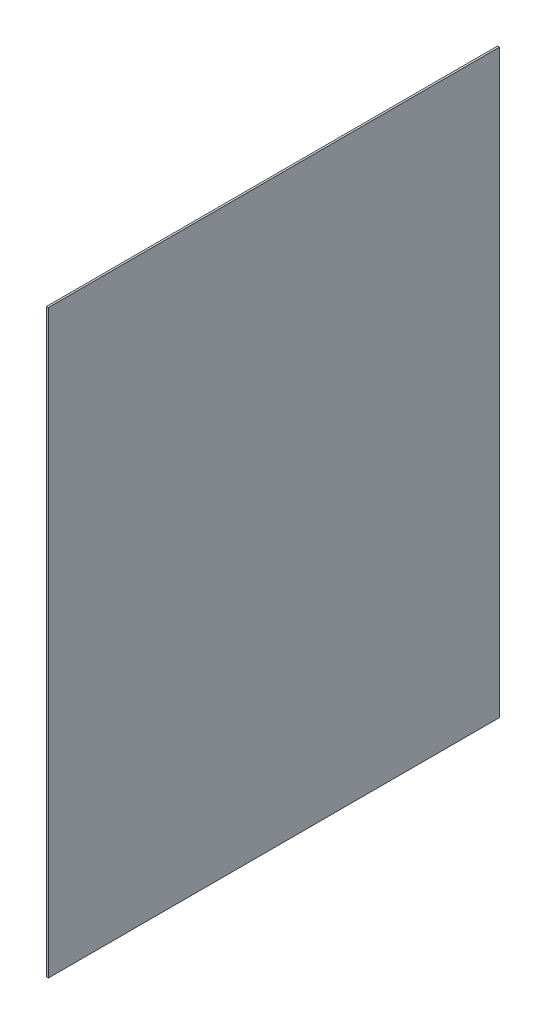
ISO-10303-21;
HEADER;
FILE_DESCRIPTION(('STEP AP214'),'2;1');
FILE_NAME('part.step','',(''),(''),'','','');
FILE_SCHEMA(('AUTOMOTIVE_DESIGN { 1 0 10303 214 1 1 1 1 }'));
ENDSEC;
DATA;
#1=APPLICATION_CONTEXT('core data for automotive mechanical design processes');
#2=APPLICATION_PROTOCOL_DEFINITION('international standard','automotive_design',2000,#1);
#3=PRODUCT_CONTEXT('',#1,'mechanical');
#4=PRODUCT('Part','Part','',(#3));
#5=PRODUCT_RELATED_PRODUCT_CATEGORY('part','',(#4));
#6=PRODUCT_DEFINITION_FORMATION('','',#4);
#7=PRODUCT_DEFINITION_CONTEXT('part definition',#1,'design');
#8=PRODUCT_DEFINITION('design','',#6,#7);
#9=PRODUCT_DEFINITION_SHAPE('','',#8);
#10=(LENGTH_UNIT() NAMED_UNIT(*) SI_UNIT(.MILLI.,.METRE.));
#11=(NAMED_UNIT(*) PLANE_ANGLE_UNIT() SI_UNIT($,.RADIAN.));
#12=(NAMED_UNIT(*) SI_UNIT($,.STERADIAN.) SOLID_ANGLE_UNIT());
#13=UNCERTAINTY_MEASURE_WITH_UNIT(LENGTH_MEASURE(1.E-05),#10,'distance_accuracy_value','');
#14=(GEOMETRIC_REPRESENTATION_CONTEXT(3) GLOBAL_UNCERTAINTY_ASSIGNED_CONTEXT((#13)) GLOBAL_UNIT_ASSIGNED_CONTEXT((#10,
#11,#12)) REPRESENTATION_CONTEXT('',''));
#15=CARTESIAN_POINT('',(0.,0.,0.));
#16=DIRECTION('',(0.,0.,1.));
#17=DIRECTION('',(1.,0.,0.));
#18=AXIS2_PLACEMENT_3D('',#15,#16,#17);
#19=CARTESIAN_POINT('',(0.1,0.,0.));
#20=DIRECTION('',(0.,0.,-1.));
#21=DIRECTION('',(-1.,0.,0.));
#22=AXIS2_PLACEMENT_3D('',#19,#20,#21);
#23=PLANE('',#22);
#24=DIRECTION('',(0.,-1.,0.));
#25=VECTOR('',#24,1.);
#26=CARTESIAN_POINT('',(0.,0.,0.));
#27=LINE('',#26,#25);
#28=CARTESIAN_POINT('',(0.,30.,0.));
#29=VERTEX_POINT('',#28);
#30=CARTESIAN_POINT('',(0.,0.,0.));
#31=VERTEX_POINT('',#30);
#32=EDGE_CURVE('E95',#29,#31,#27,.T.);
#33=ORIENTED_EDGE('',*,*,#32,.T.);
#34=DIRECTION('',(-1.,0.,0.));
#35=VECTOR('',#34,1.);
#36=CARTESIAN_POINT('',(0.1,0.,0.));
#37=LINE('',#36,#35);
#38=CARTESIAN_POINT('',(0.1,0.,0.));
#39=VERTEX_POINT('',#38);
#40=EDGE_CURVE('E11',#39,#31,#37,.T.);
#41=ORIENTED_EDGE('',*,*,#40,.F.);
#42=DIRECTION('',(0.,-1.,0.));
#43=VECTOR('',#42,1.);
#44=CARTESIAN_POINT('',(0.1,0.,0.));
#45=LINE('',#44,#43);
#46=CARTESIAN_POINT('',(0.1,30.,0.));
#47=VERTEX_POINT('',#46);
#48=EDGE_CURVE('E83',#47,#39,#45,.T.);
#49=ORIENTED_EDGE('',*,*,#48,.F.);
#50=DIRECTION('',(-1.,0.,0.));
#51=VECTOR('',#50,1.);
#52=CARTESIAN_POINT('',(0.1,30.,0.));
#53=LINE('',#52,#51);
#54=EDGE_CURVE('E91',#47,#29,#53,.T.);
#55=ORIENTED_EDGE('',*,*,#54,.T.);
#56=EDGE_LOOP('',(#33,#41,#49,#55));
#57=FACE_BOUND('',#56,.T.);
#58=ADVANCED_FACE('F32',(#57),#23,.F.);
#59=CARTESIAN_POINT('',(0.1,0.,0.));
#60=DIRECTION('',(0.,1.,0.));
#61=DIRECTION('',(0.,0.,1.));
#62=AXIS2_PLACEMENT_3D('',#59,#60,#61);
#63=PLANE('',#62);
#64=DIRECTION('',(0.,0.,-1.));
#65=VECTOR('',#64,1.);
#66=CARTESIAN_POINT('',(0.,0.,0.));
#67=LINE('',#66,#65);
#68=CARTESIAN_POINT('',(0.,0.,-23.3));
#69=VERTEX_POINT('',#68);
#70=EDGE_CURVE('E87',#31,#69,#67,.T.);
#71=ORIENTED_EDGE('',*,*,#70,.T.);
#72=DIRECTION('',(-1.,0.,0.));
#73=VECTOR('',#72,1.);
#74=CARTESIAN_POINT('',(0.1,0.,-23.3));
#75=LINE('',#74,#73);
#76=CARTESIAN_POINT('',(0.1,0.,-23.3));
#77=VERTEX_POINT('',#76);
#78=EDGE_CURVE('E40',#77,#69,#75,.T.);
#79=ORIENTED_EDGE('',*,*,#78,.F.);
#80=DIRECTION('',(0.,0.,-1.));
#81=VECTOR('',#80,1.);
#82=CARTESIAN_POINT('',(0.1,0.,0.));
#83=LINE('',#82,#81);
#84=EDGE_CURVE('E78',#39,#77,#83,.T.);
#85=ORIENTED_EDGE('',*,*,#84,.F.);
#86=ORIENTED_EDGE('',*,*,#40,.T.);
#87=EDGE_LOOP('',(#71,#79,#85,#86));
#88=FACE_BOUND('',#87,.T.);
#89=ADVANCED_FACE('F86',(#88),#63,.F.);
#90=CARTESIAN_POINT('',(0.1,0.,-23.3));
#91=DIRECTION('',(0.,0.,1.));
#92=DIRECTION('',(1.,0.,0.));
#93=AXIS2_PLACEMENT_3D('',#90,#91,#92);
#94=PLANE('',#93);
#95=DIRECTION('',(0.,1.,0.));
#96=VECTOR('',#95,1.);
#97=CARTESIAN_POINT('',(0.,0.,-23.3));
#98=LINE('',#97,#96);
#99=CARTESIAN_POINT('',(0.,30.,-23.3));
#100=VERTEX_POINT('',#99);
#101=EDGE_CURVE('E65',#69,#100,#98,.T.);
#102=ORIENTED_EDGE('',*,*,#101,.T.);
#103=DIRECTION('',(-1.,0.,0.));
#104=VECTOR('',#103,1.);
#105=CARTESIAN_POINT('',(0.1,30.,-23.3));
#106=LINE('',#105,#104);
#107=CARTESIAN_POINT('',(0.1,30.,-23.3));
#108=VERTEX_POINT('',#107);
#109=EDGE_CURVE('E88',#108,#100,#106,.T.);
#110=ORIENTED_EDGE('',*,*,#109,.F.);
#111=DIRECTION('',(0.,1.,0.));
#112=VECTOR('',#111,1.);
#113=CARTESIAN_POINT('',(0.1,0.,-23.3));
#114=LINE('',#113,#112);
#115=EDGE_CURVE('E81',#77,#108,#114,.T.);
#116=ORIENTED_EDGE('',*,*,#115,.F.);
#117=ORIENTED_EDGE('',*,*,#78,.T.);
#118=EDGE_LOOP('',(#102,#110,#116,#117));
#119=FACE_BOUND('',#118,.T.);
#120=ADVANCED_FACE('F89',(#119),#94,.F.);
#121=CARTESIAN_POINT('',(0.1,30.,0.));
#122=DIRECTION('',(0.,-1.,0.));
#123=DIRECTION('',(0.,0.,-1.));
#124=AXIS2_PLACEMENT_3D('',#121,#122,#123);
#125=PLANE('',#124);
#126=DIRECTION('',(0.,0.,1.));
#127=VECTOR('',#126,1.);
#128=CARTESIAN_POINT('',(0.,30.,0.));
#129=LINE('',#128,#127);
#130=EDGE_CURVE('E71',#100,#29,#129,.T.);
#131=ORIENTED_EDGE('',*,*,#130,.T.);
#132=ORIENTED_EDGE('',*,*,#54,.F.);
#133=DIRECTION('',(0.,0.,1.));
#134=VECTOR('',#133,1.);
#135=CARTESIAN_POINT('',(0.1,30.,0.));
#136=LINE('',#135,#134);
#137=EDGE_CURVE('E48',#108,#47,#136,.T.);
#138=ORIENTED_EDGE('',*,*,#137,.F.);
#139=ORIENTED_EDGE('',*,*,#109,.T.);
#140=EDGE_LOOP('',(#131,#132,#138,#139));
#141=FACE_BOUND('',#140,.T.);
#142=ADVANCED_FACE('F102',(#141),#125,.F.);
#143=CARTESIAN_POINT('',(0.1,0.,0.));
#144=DIRECTION('',(-1.,0.,0.));
#145=DIRECTION('',(0.,0.,1.));
#146=AXIS2_PLACEMENT_3D('',#143,#144,#145);
#147=PLANE('',#146);
#148=ORIENTED_EDGE('',*,*,#48,.T.);
#149=ORIENTED_EDGE('',*,*,#84,.T.);
#150=ORIENTED_EDGE('',*,*,#115,.T.);
#151=ORIENTED_EDGE('',*,*,#137,.T.);
#152=EDGE_LOOP('',(#148,#149,#150,#151));
#153=FACE_BOUND('',#152,.T.);
#154=ADVANCED_FACE('F79',(#153),#147,.F.);
#155=CARTESIAN_POINT('',(0.,0.,0.));
#156=DIRECTION('',(-1.,0.,0.));
#157=DIRECTION('',(0.,0.,1.));
#158=AXIS2_PLACEMENT_3D('',#155,#156,#157);
#159=PLANE('',#158);
#160=ORIENTED_EDGE('',*,*,#32,.F.);
#161=ORIENTED_EDGE('',*,*,#130,.F.);
#162=ORIENTED_EDGE('',*,*,#101,.F.);
#163=ORIENTED_EDGE('',*,*,#70,.F.);
#164=EDGE_LOOP('',(#160,#161,#162,#163));
#165=FACE_BOUND('',#164,.T.);
#166=ADVANCED_FACE('F105',(#165),#159,.T.);
#167=CLOSED_SHELL('',(#58,#89,#120,#142,#154,#166));
#168=MANIFOLD_SOLID_BREP('B2',#167);
#169=ADVANCED_BREP_SHAPE_REPRESENTATION('',(#18,#168),#14);
#170=SHAPE_DEFINITION_REPRESENTATION(#9,#169);
ENDSEC;
END-ISO-10303-21;
